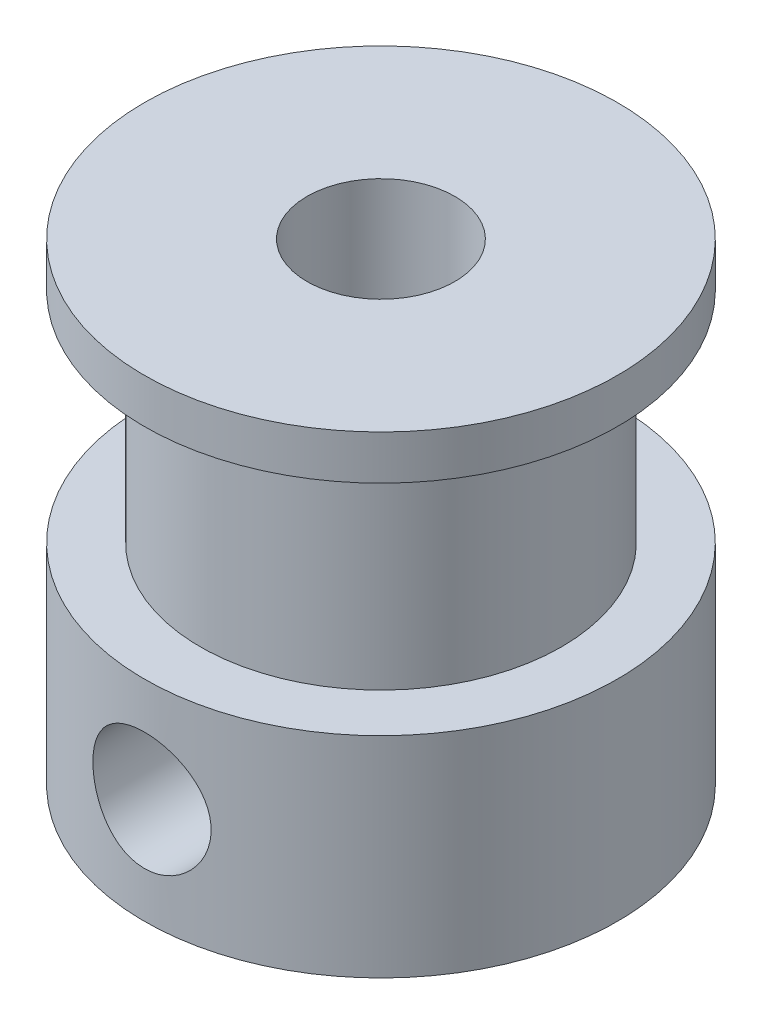
ISO-10303-21;
HEADER;
FILE_DESCRIPTION(('STEP AP214'),'2;1');
FILE_NAME('part.step','',(''),(''),'','','');
FILE_SCHEMA(('AUTOMOTIVE_DESIGN { 1 0 10303 214 1 1 1 1 }'));
ENDSEC;
DATA;
#1=APPLICATION_CONTEXT('core data for automotive mechanical design processes');
#2=APPLICATION_PROTOCOL_DEFINITION('international standard','automotive_design',2000,#1);
#3=PRODUCT_CONTEXT('',#1,'mechanical');
#4=PRODUCT('Part','Part','',(#3));
#5=PRODUCT_RELATED_PRODUCT_CATEGORY('part','',(#4));
#6=PRODUCT_DEFINITION_FORMATION('','',#4);
#7=PRODUCT_DEFINITION_CONTEXT('part definition',#1,'design');
#8=PRODUCT_DEFINITION('design','',#6,#7);
#9=PRODUCT_DEFINITION_SHAPE('','',#8);
#10=(LENGTH_UNIT() NAMED_UNIT(*) SI_UNIT(.MILLI.,.METRE.));
#11=(NAMED_UNIT(*) PLANE_ANGLE_UNIT() SI_UNIT($,.RADIAN.));
#12=(NAMED_UNIT(*) SI_UNIT($,.STERADIAN.) SOLID_ANGLE_UNIT());
#13=UNCERTAINTY_MEASURE_WITH_UNIT(LENGTH_MEASURE(1.E-05),#10,'distance_accuracy_value','');
#14=(GEOMETRIC_REPRESENTATION_CONTEXT(3) GLOBAL_UNCERTAINTY_ASSIGNED_CONTEXT((#13)) GLOBAL_UNIT_ASSIGNED_CONTEXT((#10,
#11,#12)) REPRESENTATION_CONTEXT('',''));
#15=CARTESIAN_POINT('',(0.,0.,0.));
#16=DIRECTION('',(0.,0.,1.));
#17=DIRECTION('',(1.,0.,0.));
#18=AXIS2_PLACEMENT_3D('',#15,#16,#17);
#19=CARTESIAN_POINT('',(2.5,19.4947792083438,0.));
#20=DIRECTION('',(0.,1.,0.));
#21=DIRECTION('',(-1.,0.,0.));
#22=AXIS2_PLACEMENT_3D('',#19,#20,#21);
#23=CYLINDRICAL_SURFACE('',#22,8.);
#24=CARTESIAN_POINT('',(2.5,7.1,0.));
#25=DIRECTION('',(0.,1.,0.));
#26=DIRECTION('',(-1.,0.,0.));
#27=AXIS2_PLACEMENT_3D('',#24,#25,#26);
#28=CIRCLE('',#27,8.);
#29=CARTESIAN_POINT('',(-5.5,7.1,0.));
#30=VERTEX_POINT('',#29);
#31=EDGE_CURVE('E47',#30,#30,#28,.T.);
#32=ORIENTED_EDGE('',*,*,#31,.F.);
#33=EDGE_LOOP('',(#32));
#34=FACE_BOUND('',#33,.T.);
#35=CARTESIAN_POINT('',(2.5,0.,0.));
#36=DIRECTION('',(0.,1.,0.));
#37=DIRECTION('',(-1.,0.,0.));
#38=AXIS2_PLACEMENT_3D('',#35,#36,#37);
#39=CIRCLE('',#38,8.);
#40=CARTESIAN_POINT('',(-5.5,0.,0.));
#41=VERTEX_POINT('',#40);
#42=EDGE_CURVE('E10',#41,#41,#39,.T.);
#43=ORIENTED_EDGE('',*,*,#42,.T.);
#44=EDGE_LOOP('',(#43));
#45=FACE_BOUND('',#44,.T.);
#46=CARTESIAN_POINT('',(0.5,3.55,7.74596669241483));
#47=CARTESIAN_POINT('',(0.500003137125542,3.66044060074126,7.74596880070288));
#48=CARTESIAN_POINT('',(0.509179003601879,3.77091591894282,7.74835444811678));
#49=CARTESIAN_POINT('',(0.545581499628966,3.98869406253881,7.75761489594051));
#50=CARTESIAN_POINT('',(0.572818634606316,4.09599500357455,7.76449230897304));
#51=CARTESIAN_POINT('',(0.644407040294368,4.30424283054974,7.7819097967692));
#52=CARTESIAN_POINT('',(0.688736217716408,4.40519772430856,7.79244514152366));
#53=CARTESIAN_POINT('',(0.793183086990893,4.5982486820319,7.81598553623007));
#54=CARTESIAN_POINT('',(0.853301449151451,4.69034436966417,7.82899069102791));
#55=CARTESIAN_POINT('',(0.989033258150494,4.86508931620977,7.856325730845));
#56=CARTESIAN_POINT('',(1.06493048983676,4.94751488028004,7.87067678098427));
#57=CARTESIAN_POINT('',(1.22945434871947,5.09860911548827,7.89890300412235));
#58=CARTESIAN_POINT('',(1.31808216465575,5.1672765004974,7.91277813253111));
#59=CARTESIAN_POINT('',(1.50708383913684,5.28982037410502,7.93872332416466));
#60=CARTESIAN_POINT('',(1.6076043390439,5.34347711052917,7.95076549920474));
#61=CARTESIAN_POINT('',(1.81658945256579,5.43304771532247,7.97144649540787));
#62=CARTESIAN_POINT('',(1.92505289136645,5.46896420153241,7.98008581867475));
#63=CARTESIAN_POINT('',(2.14451299299667,5.52131826766287,7.99283807078544));
#64=CARTESIAN_POINT('',(2.25541382436082,5.53813571546126,7.99703915075451));
#65=CARTESIAN_POINT('',(2.47853694458979,5.55300670342044,8.00074875285838));
#66=CARTESIAN_POINT('',(2.59075903563046,5.55106301776768,8.00025796877363));
#67=CARTESIAN_POINT('',(2.81070449434478,5.52874011979988,7.99470475962828));
#68=CARTESIAN_POINT('',(2.91847243120213,5.50877093995691,7.98974401872699));
#69=CARTESIAN_POINT('',(3.12907649482737,5.4516229839612,7.97592669219883));
#70=CARTESIAN_POINT('',(3.23191235874088,5.41444329169807,7.96706989918753));
#71=CARTESIAN_POINT('',(3.43081340700361,5.32359794345035,7.94630007760717));
#72=CARTESIAN_POINT('',(3.52680901953301,5.2697863642706,7.93436015756043));
#73=CARTESIAN_POINT('',(3.70855124468098,5.14731545670699,7.90871923047719));
#74=CARTESIAN_POINT('',(3.79429607017101,5.0786535451515,7.89501791721992));
#75=CARTESIAN_POINT('',(3.95554807016991,4.9262330064141,7.86690971015616));
#76=CARTESIAN_POINT('',(4.0307153581504,4.84211608612178,7.85249375620734));
#77=CARTESIAN_POINT('',(4.16595275192604,4.6623200211678,7.82492034813365));
#78=CARTESIAN_POINT('',(4.22602215209203,4.5666403364072,7.81176295284776));
#79=CARTESIAN_POINT('',(4.3295762580452,4.36576797268083,7.78816397465319));
#80=CARTESIAN_POINT('',(4.37297913394098,4.26053141574944,7.77773586980577));
#81=CARTESIAN_POINT('',(4.44137124127268,4.04393162553884,7.76094912111966));
#82=CARTESIAN_POINT('',(4.46636441310582,3.93256970881349,7.75458960648175));
#83=CARTESIAN_POINT('',(4.49666371093214,3.7100323987815,7.74684284831313));
#84=CARTESIAN_POINT('',(4.5024723791357,3.5989297653363,7.74532871274919));
#85=CARTESIAN_POINT('',(4.49561359241244,3.37734245073747,7.74709874784832));
#86=CARTESIAN_POINT('',(4.48294783827904,3.26685771363901,7.75038247681013));
#87=CARTESIAN_POINT('',(4.43994037115013,3.05150858803623,7.76125665563648));
#88=CARTESIAN_POINT('',(4.4098912546254,2.94658181874332,7.768775761875));
#89=CARTESIAN_POINT('',(4.3332944653365,2.74325483371865,7.7872057461677));
#90=CARTESIAN_POINT('',(4.28674483817004,2.64485539275573,7.79811702598891));
#91=CARTESIAN_POINT('',(4.17741653434925,2.45524697770612,7.8223690967461));
#92=CARTESIAN_POINT('',(4.1143374030685,2.36421692796552,7.83575334885313));
#93=CARTESIAN_POINT('',(3.97412058586891,2.19384930975892,7.86333666457373));
#94=CARTESIAN_POINT('',(3.89698058961088,2.11451366667994,7.87753586182776));
#95=CARTESIAN_POINT('',(3.72852544196945,1.96775116594323,7.90557922425285));
#96=CARTESIAN_POINT('',(3.63690390506319,1.90067194996095,7.91940561649468));
#97=CARTESIAN_POINT('',(3.44340536538935,1.782851306439,7.94477773290987));
#98=CARTESIAN_POINT('',(3.34152889791518,1.73210902671343,7.95632357603169));
#99=CARTESIAN_POINT('',(3.13111640346218,1.64884317237765,7.9757609259065));
#100=CARTESIAN_POINT('',(3.02263476205576,1.61618857249675,7.98367864017925));
#101=CARTESIAN_POINT('',(2.80149952063761,1.56963173231327,7.99508234716634));
#102=CARTESIAN_POINT('',(2.68884673008248,1.55572587300877,7.99856919514738));
#103=CARTESIAN_POINT('',(2.46583294711335,1.54726482084892,8.00068338817612));
#104=CARTESIAN_POINT('',(2.35549234606796,1.55219658180918,7.99943957759977));
#105=CARTESIAN_POINT('',(2.1372650071705,1.5800956545887,7.99251792914887));
#106=CARTESIAN_POINT('',(2.02937819643814,1.60306243002634,7.98684022314338));
#107=CARTESIAN_POINT('',(1.81965792871045,1.66610443954172,7.97170865707778));
#108=CARTESIAN_POINT('',(1.71779501083827,1.70608690662876,7.96227529004785));
#109=CARTESIAN_POINT('',(1.52216589391675,1.80194115803914,7.94062577827316));
#110=CARTESIAN_POINT('',(1.42840071746873,1.85781494534097,7.92840928277515));
#111=CARTESIAN_POINT('',(1.24919614315339,1.98543046799226,7.90214499360574));
#112=CARTESIAN_POINT('',(1.16401002340333,2.05752028580766,7.88806033883329));
#113=CARTESIAN_POINT('',(1.00676995945299,2.21484570395469,7.85981298114379));
#114=CARTESIAN_POINT('',(0.93471934984682,2.30008463222233,7.84565025934604));
#115=CARTESIAN_POINT('',(0.804475947056337,2.48320282837892,7.81854951691005));
#116=CARTESIAN_POINT('',(0.746566761167243,2.58128824673051,7.80563927346578));
#117=CARTESIAN_POINT('',(0.648146206829061,2.78611097974964,7.78287910989656));
#118=CARTESIAN_POINT('',(0.607622180495696,2.89284193218769,7.77302696466427));
#119=CARTESIAN_POINT('',(0.551154942857995,3.09115402367032,7.75903817501475));
#120=CARTESIAN_POINT('',(0.532013658806243,3.18178632877227,7.75417326006998));
#121=CARTESIAN_POINT('',(0.506435414856461,3.36493773799537,7.7476367716524));
#122=CARTESIAN_POINT('',(0.4999973712565,3.4574566804888,7.74596492578216));
#123=CARTESIAN_POINT('',(0.5,3.55,7.74596669241483));
#124=B_SPLINE_CURVE_WITH_KNOTS('',3,(#46,#47,#48,#49,#50,#51,#52,#53,#54,#55,#56,#57,#58,#59,
#60,#61,#62,#63,#64,#65,#66,#67,#68,#69,#70,#71,#72,#73,#74,#75,#76,#77,#78,#79,#80,#81,#82,#83,
#84,#85,#86,#87,#88,#89,#90,#91,#92,#93,#94,#95,#96,#97,#98,#99,#100,#101,#102,#103,#104,#105,
#106,#107,#108,#109,#110,#111,#112,#113,#114,#115,#116,#117,#118,#119,#120,#121,#122,#123),
.UNSPECIFIED.,.T.,.F.,(4,2,2,2,2,2,2,2,2,2,2,2,2,2,2,2,2,2,2,2,2,2,2,2,2,2,2,2,2,2,2,2,2,2,2,2,
2,2,4),(0.,0.330981953388909,0.662156593142933,0.992904581732816,1.32366661404383,
1.66099163354381,1.99834817183893,2.34041197118336,2.68242527877674,3.01751000796277,
3.35254518932816,3.68014610151158,4.00776445379829,4.33834299403556,4.66897908375131,
5.00856373257529,5.34816424959842,5.68941145606722,6.03058560103638,6.36274859809374,
6.69488101747042,7.02157924007366,7.34831617137134,7.68146276687326,8.01466415108036,
8.35620264772256,8.69772332575643,9.03673658245544,9.37568439127231,9.70546756901966,
10.0352409390159,10.3632390124777,10.6912784459046,11.0271767726566,11.3631602525241,
11.7054118182895,12.0474137709606,12.3247826174462,12.6021278008238),.UNSPECIFIED.);
#125=CARTESIAN_POINT('',(0.5,3.55,7.74596669241483));
#126=VERTEX_POINT('',#125);
#127=EDGE_CURVE('E71',#126,#126,#124,.T.);
#128=ORIENTED_EDGE('',*,*,#127,.T.);
#129=EDGE_LOOP('',(#128));
#130=FACE_BOUND('',#129,.T.);
#131=ADVANCED_FACE('F34',(#34,#45,#130),#23,.T.);
#132=CARTESIAN_POINT('',(2.5,19.4947792083438,0.));
#133=DIRECTION('',(0.,1.,0.));
#134=DIRECTION('',(-1.,0.,0.));
#135=AXIS2_PLACEMENT_3D('',#132,#133,#134);
#136=CYLINDRICAL_SURFACE('',#135,2.5);
#137=CARTESIAN_POINT('',(2.5,0.,0.));
#138=DIRECTION('',(0.,1.,0.));
#139=DIRECTION('',(-1.,0.,0.));
#140=AXIS2_PLACEMENT_3D('',#137,#138,#139);
#141=CIRCLE('',#140,2.5);
#142=CARTESIAN_POINT('',(0.,0.,0.));
#143=VERTEX_POINT('',#142);
#144=EDGE_CURVE('E68',#143,#143,#141,.T.);
#145=ORIENTED_EDGE('',*,*,#144,.F.);
#146=EDGE_LOOP('',(#145));
#147=FACE_BOUND('',#146,.T.);
#148=CARTESIAN_POINT('',(2.5,16.,0.));
#149=DIRECTION('',(0.,1.,0.));
#150=DIRECTION('',(-1.,0.,0.));
#151=AXIS2_PLACEMENT_3D('',#148,#149,#150);
#152=CIRCLE('',#151,2.5);
#153=CARTESIAN_POINT('',(0.,16.,0.));
#154=VERTEX_POINT('',#153);
#155=EDGE_CURVE('E65',#154,#154,#152,.T.);
#156=ORIENTED_EDGE('',*,*,#155,.T.);
#157=EDGE_LOOP('',(#156));
#158=FACE_BOUND('',#157,.T.);
#159=CARTESIAN_POINT('',(0.5,3.55,1.5));
#160=CARTESIAN_POINT('',(0.500010043615803,3.47491898261144,1.5000227575991));
#161=CARTESIAN_POINT('',(0.504277569850411,3.39972107390638,1.50575588676017));
#162=CARTESIAN_POINT('',(0.520956495653619,3.25168547057038,1.52759797098302));
#163=CARTESIAN_POINT('',(0.533395840610775,3.17885677818786,1.54374252679463));
#164=CARTESIAN_POINT('',(0.571117109875402,3.01239458049145,1.59078313764401));
#165=CARTESIAN_POINT('',(0.599364121472162,2.92035749290045,1.62485949442394));
#166=CARTESIAN_POINT('',(0.667135870877655,2.74403185983871,1.70094533012843));
#167=CARTESIAN_POINT('',(0.706692393162593,2.65976605033286,1.74297705283045));
#168=CARTESIAN_POINT('',(0.812222433878274,2.46966034321948,1.84624966659378));
#169=CARTESIAN_POINT('',(0.882576362882394,2.36703342587271,1.90894188114929));
#170=CARTESIAN_POINT('',(1.0413806493526,2.17602316478778,2.03287996747903));
#171=CARTESIAN_POINT('',(1.12981592317799,2.0876280578861,2.0941269976447));
#172=CARTESIAN_POINT('',(1.30523973721194,1.94289508042252,2.19790674394511));
#173=CARTESIAN_POINT('',(1.38906623853311,1.88367371731592,2.24174680788007));
#174=CARTESIAN_POINT('',(1.56755524449244,1.7776340400337,2.32165152523267));
#175=CARTESIAN_POINT('',(1.66220057790505,1.73079645179912,2.35772824500368));
#176=CARTESIAN_POINT('',(1.84468291777745,1.65828703941934,2.41415644696378));
#177=CARTESIAN_POINT('',(1.93114641424431,1.63041743542388,2.43610736091393));
#178=CARTESIAN_POINT('',(2.10881194707801,1.586501304746,2.47085912284979));
#179=CARTESIAN_POINT('',(2.20001136268738,1.57044831208995,2.48366497483986));
#180=CARTESIAN_POINT('',(2.38495166486348,1.55114190670986,2.49907968883617));
#181=CARTESIAN_POINT('',(2.4787002286273,1.54793280731136,2.50165324772141));
#182=CARTESIAN_POINT('',(2.66541636642814,1.55466423487218,2.49626936144757));
#183=CARTESIAN_POINT('',(2.75838390412224,1.56460537036854,2.48831142893578));
#184=CARTESIAN_POINT('',(2.9356835684361,1.59606798631304,2.4632836571348));
#185=CARTESIAN_POINT('',(3.0202101889175,1.61692881695607,2.44673404857181));
#186=CARTESIAN_POINT('',(3.18417186217243,1.66869523425223,2.40604493660584));
#187=CARTESIAN_POINT('',(3.26360562412977,1.69960335549757,2.38190351809567));
#188=CARTESIAN_POINT('',(3.42352731823444,1.77360069858851,2.32486221996811));
#189=CARTESIAN_POINT('',(3.50337969293305,1.8175765160147,2.29134265660255));
#190=CARTESIAN_POINT('',(3.65470891362336,1.9145378595917,2.21894043646479));
#191=CARTESIAN_POINT('',(3.72618103296473,1.96752842936308,2.18005477975511));
#192=CARTESIAN_POINT('',(3.87426521356107,2.09306186879885,2.09053510980241));
#193=CARTESIAN_POINT('',(3.94890108738507,2.16738361420486,2.03913144290366));
#194=CARTESIAN_POINT('',(4.08538384993672,2.32625590365074,1.9349237792571));
#195=CARTESIAN_POINT('',(4.14721494436041,2.41081887867427,1.88211814269102));
#196=CARTESIAN_POINT('',(4.25228528490805,2.58122019581792,1.78441317626436));
#197=CARTESIAN_POINT('',(4.29674173995946,2.6661509405137,1.73924224553799));
#198=CARTESIAN_POINT('',(4.37389106987979,2.84436646633452,1.65582105773209));
#199=CARTESIAN_POINT('',(4.40660965872838,2.93763242033764,1.61755576516689));
#200=CARTESIAN_POINT('',(4.45062199735974,3.10279160402775,1.56393805143324));
#201=CARTESIAN_POINT('',(4.46540293714784,3.1726128308979,1.54515601955457));
#202=CARTESIAN_POINT('',(4.48746978122375,3.31518020595415,1.51667304681101));
#203=CARTESIAN_POINT('',(4.49477239579985,3.38791945391066,1.50695186390374));
#204=CARTESIAN_POINT('',(4.5012999442642,3.53486337792737,1.49827790293909));
#205=CARTESIAN_POINT('',(4.50047806264257,3.60907408505744,1.49938753445573));
#206=CARTESIAN_POINT('',(4.49072610261057,3.75604732503741,1.51230456185753));
#207=CARTESIAN_POINT('',(4.48178458332099,3.82880766638746,1.52412705251965));
#208=CARTESIAN_POINT('',(4.45331430449204,3.98906320266182,1.56051508430774));
#209=CARTESIAN_POINT('',(4.4316709289088,4.07559826813084,1.58755721486228));
#210=CARTESIAN_POINT('',(4.37841388450525,4.24229086608547,1.65022809339808));
#211=CARTESIAN_POINT('',(4.34677049067316,4.3224284809031,1.6858823654909));
#212=CARTESIAN_POINT('',(4.25807608919816,4.51152892934929,1.77903249993889));
#213=CARTESIAN_POINT('',(4.19602510944931,4.61689533432516,1.83905564347524));
#214=CARTESIAN_POINT('',(4.05438039564658,4.81438414924201,1.96026853157683));
#215=CARTESIAN_POINT('',(3.97476601547362,4.90649075968346,2.0214595710443));
#216=CARTESIAN_POINT('',(3.79702304107541,5.07746280734504,2.13993299259158));
#217=CARTESIAN_POINT('',(3.69864860522963,5.15612262911307,2.19714788259661));
#218=CARTESIAN_POINT('',(3.48497027774132,5.29526652744419,2.30083046289375));
#219=CARTESIAN_POINT('',(3.36972320345519,5.35580960567063,2.34733292440641));
#220=CARTESIAN_POINT('',(3.16453199414098,5.43849058746688,2.41163161860483));
#221=CARTESIAN_POINT('',(3.07840826512334,5.46671737697411,2.43384921549886));
#222=CARTESIAN_POINT('',(2.90136538123563,5.51143213496397,2.46921550391513));
#223=CARTESIAN_POINT('',(2.81044994417906,5.52792906454061,2.48237111815073));
#224=CARTESIAN_POINT('',(2.62596135805231,5.5481928241047,2.49854699723995));
#225=CARTESIAN_POINT('',(2.53237975614545,5.55191320505831,2.50153028039159));
#226=CARTESIAN_POINT('',(2.34587050502845,5.54623349073478,2.49698719993361));
#227=CARTESIAN_POINT('',(2.25294290232881,5.5368324715917,2.48946009629711));
#228=CARTESIAN_POINT('',(2.07551501669216,5.50639645290878,2.46524008405095));
#229=CARTESIAN_POINT('',(1.99082984089839,5.48601066859715,2.44905900306101));
#230=CARTESIAN_POINT('',(1.82647945764325,5.43514657868653,2.4090520196301));
#231=CARTESIAN_POINT('',(1.74681555669647,5.40466565917398,2.3852241372675));
#232=CARTESIAN_POINT('',(1.58661640814813,5.33162545560744,2.32886203207213));
#233=CARTESIAN_POINT('',(1.50668991184603,5.288206157889,2.29572397002092));
#234=CARTESIAN_POINT('',(1.35513603873694,5.19235766290537,2.22403396009593));
#235=CARTESIAN_POINT('',(1.28351310223692,5.1399236819315,2.18547913977515));
#236=CARTESIAN_POINT('',(1.13511776004602,5.01570378699631,2.0966685242987));
#237=CARTESIAN_POINT('',(1.06029196206359,4.94215358668458,2.04563299169992));
#238=CARTESIAN_POINT('',(0.923306469200094,4.7848830744766,1.94201312920059));
#239=CARTESIAN_POINT('',(0.861162714169465,4.70115017239466,1.88942694411833));
#240=CARTESIAN_POINT('',(0.754487386336596,4.53104245547041,1.79109125321811));
#241=CARTESIAN_POINT('',(0.708938599353411,4.44542747878393,1.74513263017547));
#242=CARTESIAN_POINT('',(0.62983695314769,4.26560811174863,1.66007449903138));
#243=CARTESIAN_POINT('',(0.59626163640355,4.17142022196226,1.6209622208173));
#244=CARTESIAN_POINT('',(0.550858600775617,4.00386067324733,1.56580101941138));
#245=CARTESIAN_POINT('',(0.535535291510366,3.9325804555928,1.54635220628733));
#246=CARTESIAN_POINT('',(0.512737173760385,3.78697572902913,1.51695472225641));
#247=CARTESIAN_POINT('',(0.505232488601066,3.71266394472205,1.50696990066825));
#248=CARTESIAN_POINT('',(0.500642577721693,3.60867478565767,1.50085460132402));
#249=CARTESIAN_POINT('',(0.499996074331553,3.57934632175653,1.49999110491774));
#250=CARTESIAN_POINT('',(0.5,3.55,1.5));
#251=B_SPLINE_CURVE_WITH_KNOTS('',3,(#159,#160,#161,#162,#163,#164,#165,#166,#167,#168,#169,
#170,#171,#172,#173,#174,#175,#176,#177,#178,#179,#180,#181,#182,#183,#184,#185,#186,#187,#188,
#189,#190,#191,#192,#193,#194,#195,#196,#197,#198,#199,#200,#201,#202,#203,#204,#205,#206,#207,
#208,#209,#210,#211,#212,#213,#214,#215,#216,#217,#218,#219,#220,#221,#222,#223,#224,#225,#226,
#227,#228,#229,#230,#231,#232,#233,#234,#235,#236,#237,#238,#239,#240,#241,#242,#243,#244,#245,
#246,#247,#248,#249,#250),.UNSPECIFIED.,.T.,.F.,(4,2,2,2,2,2,2,2,2,2,2,2,2,2,2,2,2,2,2,2,2,2,2,
2,2,2,2,2,2,2,2,2,2,2,2,2,2,2,2,2,2,2,2,2,2,4),(0.,0.225140818813291,0.451055593895016,
0.755714384660879,1.06123795594964,1.47720804611674,1.8928325353688,2.22639303179097,
2.55943127851025,2.83862094435178,3.11765772560939,3.39765639927928,3.67766803055209,
3.94241917501297,4.20723715914626,4.49756510688428,4.78805602626153,5.13841226546405,
5.48919811771068,5.80619193384967,6.12248701337037,6.34307726284838,6.56317352160417,
6.78453876949456,7.00621641426759,7.28428560377195,7.56318925297414,7.96975811975667,
8.37680748728571,8.78961174948154,9.20105660259845,9.47985927613152,9.75844872724253,
10.0380499218877,10.3176708039936,10.5823344198312,10.8470666181456,11.1364335884202,
11.4259545900794,11.7747351905783,12.1239515037794,12.4449574092071,12.7653580273015,
12.9909138326702,13.2156045429056,13.3036035490356),.UNSPECIFIED.);
#252=CARTESIAN_POINT('',(0.5,3.55,1.5));
#253=VERTEX_POINT('',#252);
#254=EDGE_CURVE('E38',#253,#253,#251,.T.);
#255=ORIENTED_EDGE('',*,*,#254,.T.);
#256=EDGE_LOOP('',(#255));
#257=FACE_BOUND('',#256,.T.);
#258=ADVANCED_FACE('F83',(#147,#158,#257),#136,.F.);
#259=CARTESIAN_POINT('',(0.,0.,0.));
#260=DIRECTION('',(0.,-1.,0.));
#261=DIRECTION('',(1.,0.,0.));
#262=AXIS2_PLACEMENT_3D('',#259,#260,#261);
#263=PLANE('',#262);
#264=ORIENTED_EDGE('',*,*,#144,.T.);
#265=EDGE_LOOP('',(#264));
#266=FACE_BOUND('',#265,.T.);
#267=ORIENTED_EDGE('',*,*,#42,.F.);
#268=EDGE_LOOP('',(#267));
#269=FACE_BOUND('',#268,.T.);
#270=ADVANCED_FACE('F36',(#266,#269),#263,.T.);
#271=CARTESIAN_POINT('',(-5.5,7.1,0.));
#272=DIRECTION('',(0.,1.,0.));
#273=DIRECTION('',(-1.,0.,0.));
#274=AXIS2_PLACEMENT_3D('',#271,#272,#273);
#275=PLANE('',#274);
#276=ORIENTED_EDGE('',*,*,#31,.T.);
#277=EDGE_LOOP('',(#276));
#278=FACE_BOUND('',#277,.T.);
#279=CARTESIAN_POINT('',(2.5,7.1,0.));
#280=DIRECTION('',(0.,1.,0.));
#281=DIRECTION('',(-1.,0.,0.));
#282=AXIS2_PLACEMENT_3D('',#279,#280,#281);
#283=CIRCLE('',#282,6.11);
#284=CARTESIAN_POINT('',(-3.61,7.1,0.));
#285=VERTEX_POINT('',#284);
#286=EDGE_CURVE('E51',#285,#285,#283,.T.);
#287=ORIENTED_EDGE('',*,*,#286,.F.);
#288=EDGE_LOOP('',(#287));
#289=FACE_BOUND('',#288,.T.);
#290=ADVANCED_FACE('F102',(#278,#289),#275,.T.);
#291=CARTESIAN_POINT('',(2.5,19.4947792083438,0.));
#292=DIRECTION('',(0.,1.,0.));
#293=DIRECTION('',(-1.,0.,0.));
#294=AXIS2_PLACEMENT_3D('',#291,#292,#293);
#295=CYLINDRICAL_SURFACE('',#294,6.11);
#296=ORIENTED_EDGE('',*,*,#286,.T.);
#297=EDGE_LOOP('',(#296));
#298=FACE_BOUND('',#297,.T.);
#299=CARTESIAN_POINT('',(2.5,14.5,0.));
#300=DIRECTION('',(0.,1.,0.));
#301=DIRECTION('',(-1.,0.,0.));
#302=AXIS2_PLACEMENT_3D('',#299,#300,#301);
#303=CIRCLE('',#302,6.11);
#304=CARTESIAN_POINT('',(-3.61,14.5,0.));
#305=VERTEX_POINT('',#304);
#306=EDGE_CURVE('E56',#305,#305,#303,.T.);
#307=ORIENTED_EDGE('',*,*,#306,.F.);
#308=EDGE_LOOP('',(#307));
#309=FACE_BOUND('',#308,.T.);
#310=ADVANCED_FACE('F99',(#298,#309),#295,.T.);
#311=CARTESIAN_POINT('',(-5.5,14.5,0.));
#312=DIRECTION('',(0.,-1.,0.));
#313=DIRECTION('',(1.,0.,0.));
#314=AXIS2_PLACEMENT_3D('',#311,#312,#313);
#315=PLANE('',#314);
#316=ORIENTED_EDGE('',*,*,#306,.T.);
#317=EDGE_LOOP('',(#316));
#318=FACE_BOUND('',#317,.T.);
#319=CARTESIAN_POINT('',(2.5,14.5,0.));
#320=DIRECTION('',(0.,1.,0.));
#321=DIRECTION('',(-1.,0.,0.));
#322=AXIS2_PLACEMENT_3D('',#319,#320,#321);
#323=CIRCLE('',#322,8.);
#324=CARTESIAN_POINT('',(-5.5,14.5,0.));
#325=VERTEX_POINT('',#324);
#326=EDGE_CURVE('E59',#325,#325,#323,.T.);
#327=ORIENTED_EDGE('',*,*,#326,.F.);
#328=EDGE_LOOP('',(#327));
#329=FACE_BOUND('',#328,.T.);
#330=ADVANCED_FACE('F95',(#318,#329),#315,.T.);
#331=CARTESIAN_POINT('',(2.5,19.4947792083438,0.));
#332=DIRECTION('',(0.,1.,0.));
#333=DIRECTION('',(-1.,0.,0.));
#334=AXIS2_PLACEMENT_3D('',#331,#332,#333);
#335=CYLINDRICAL_SURFACE('',#334,8.);
#336=ORIENTED_EDGE('',*,*,#326,.T.);
#337=EDGE_LOOP('',(#336));
#338=FACE_BOUND('',#337,.T.);
#339=CARTESIAN_POINT('',(2.5,16.,0.));
#340=DIRECTION('',(0.,1.,0.));
#341=DIRECTION('',(-1.,0.,0.));
#342=AXIS2_PLACEMENT_3D('',#339,#340,#341);
#343=CIRCLE('',#342,8.);
#344=CARTESIAN_POINT('',(-5.5,16.,0.));
#345=VERTEX_POINT('',#344);
#346=EDGE_CURVE('E62',#345,#345,#343,.T.);
#347=ORIENTED_EDGE('',*,*,#346,.F.);
#348=EDGE_LOOP('',(#347));
#349=FACE_BOUND('',#348,.T.);
#350=ADVANCED_FACE('F91',(#338,#349),#335,.T.);
#351=CARTESIAN_POINT('',(0.,16.,0.));
#352=DIRECTION('',(0.,1.,0.));
#353=DIRECTION('',(-1.,0.,0.));
#354=AXIS2_PLACEMENT_3D('',#351,#352,#353);
#355=PLANE('',#354);
#356=ORIENTED_EDGE('',*,*,#346,.T.);
#357=EDGE_LOOP('',(#356));
#358=FACE_BOUND('',#357,.T.);
#359=ORIENTED_EDGE('',*,*,#155,.F.);
#360=EDGE_LOOP('',(#359));
#361=FACE_BOUND('',#360,.T.);
#362=ADVANCED_FACE('F81',(#358,#361),#355,.T.);
#363=CARTESIAN_POINT('',(2.5,3.55,10.));
#364=DIRECTION('',(0.,0.,-1.));
#365=DIRECTION('',(-1.,0.,0.));
#366=AXIS2_PLACEMENT_3D('',#363,#364,#365);
#367=CYLINDRICAL_SURFACE('',#366,2.);
#368=ORIENTED_EDGE('',*,*,#127,.F.);
#369=EDGE_LOOP('',(#368));
#370=FACE_BOUND('',#369,.T.);
#371=ORIENTED_EDGE('',*,*,#254,.F.);
#372=EDGE_LOOP('',(#371));
#373=FACE_BOUND('',#372,.T.);
#374=ADVANCED_FACE('F78',(#370,#373),#367,.F.);
#375=CLOSED_SHELL('',(#131,#258,#270,#290,#310,#330,#350,#362,#374));
#376=MANIFOLD_SOLID_BREP('B2',#375);
#377=ADVANCED_BREP_SHAPE_REPRESENTATION('',(#18,#376),#14);
#378=SHAPE_DEFINITION_REPRESENTATION(#9,#377);
ENDSEC;
END-ISO-10303-21;
